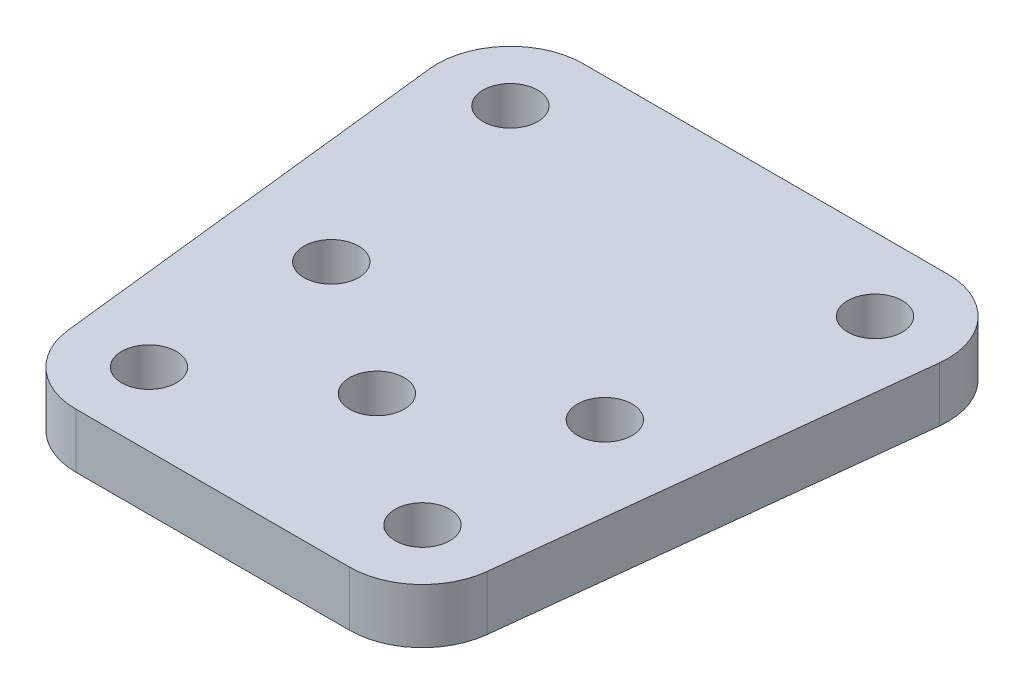
ISO-10303-21;
HEADER;
FILE_DESCRIPTION(('STEP AP214'),'2;1');
FILE_NAME('part.step','',(''),(''),'','','');
FILE_SCHEMA(('AUTOMOTIVE_DESIGN { 1 0 10303 214 1 1 1 1 }'));
ENDSEC;
DATA;
#1=APPLICATION_CONTEXT('core data for automotive mechanical design processes');
#2=APPLICATION_PROTOCOL_DEFINITION('international standard','automotive_design',2000,#1);
#3=PRODUCT_CONTEXT('',#1,'mechanical');
#4=PRODUCT('Part','Part','',(#3));
#5=PRODUCT_RELATED_PRODUCT_CATEGORY('part','',(#4));
#6=PRODUCT_DEFINITION_FORMATION('','',#4);
#7=PRODUCT_DEFINITION_CONTEXT('part definition',#1,'design');
#8=PRODUCT_DEFINITION('design','',#6,#7);
#9=PRODUCT_DEFINITION_SHAPE('','',#8);
#10=(LENGTH_UNIT() NAMED_UNIT(*) SI_UNIT(.MILLI.,.METRE.));
#11=(NAMED_UNIT(*) PLANE_ANGLE_UNIT() SI_UNIT($,.RADIAN.));
#12=(NAMED_UNIT(*) SI_UNIT($,.STERADIAN.) SOLID_ANGLE_UNIT());
#13=UNCERTAINTY_MEASURE_WITH_UNIT(LENGTH_MEASURE(1.E-05),#10,'distance_accuracy_value','');
#14=(GEOMETRIC_REPRESENTATION_CONTEXT(3) GLOBAL_UNCERTAINTY_ASSIGNED_CONTEXT((#13)) GLOBAL_UNIT_ASSIGNED_CONTEXT((#10,
#11,#12)) REPRESENTATION_CONTEXT('',''));
#15=CARTESIAN_POINT('',(0.,0.,0.));
#16=DIRECTION('',(0.,0.,1.));
#17=DIRECTION('',(1.,0.,0.));
#18=AXIS2_PLACEMENT_3D('',#15,#16,#17);
#19=CARTESIAN_POINT('',(-6.48360028265578,3.,-9.78305461340109));
#20=DIRECTION('',(0.,1.,0.));
#21=DIRECTION('',(0.,0.,1.));
#22=AXIS2_PLACEMENT_3D('',#19,#20,#21);
#23=PLANE('',#22);
#24=CARTESIAN_POINT('',(13.5163997173442,3.,-9.78305461340117));
#25=DIRECTION('',(0.,1.,0.));
#26=DIRECTION('',(0.,0.,1.));
#27=AXIS2_PLACEMENT_3D('',#24,#25,#26);
#28=CIRCLE('',#27,1.49999999999999);
#29=CARTESIAN_POINT('',(13.5163997173442,3.,-8.28305461340118));
#30=VERTEX_POINT('',#29);
#31=EDGE_CURVE('E251',#30,#30,#28,.T.);
#32=ORIENTED_EDGE('',*,*,#31,.F.);
#33=EDGE_LOOP('',(#32));
#34=FACE_BOUND('',#33,.T.);
#35=CARTESIAN_POINT('',(11.0163997173443,3.,2.53745346228764));
#36=DIRECTION('',(0.,1.,0.));
#37=DIRECTION('',(0.,0.,1.));
#38=AXIS2_PLACEMENT_3D('',#35,#36,#37);
#39=CIRCLE('',#38,1.49999999999999);
#40=CARTESIAN_POINT('',(11.0163997173443,3.,4.03745346228764));
#41=VERTEX_POINT('',#40);
#42=EDGE_CURVE('E235',#41,#41,#39,.T.);
#43=ORIENTED_EDGE('',*,*,#42,.F.);
#44=EDGE_LOOP('',(#43));
#45=FACE_BOUND('',#44,.T.);
#46=CARTESIAN_POINT('',(11.0163997173443,3.,12.5374534622876));
#47=DIRECTION('',(0.,1.,0.));
#48=DIRECTION('',(0.,0.,1.));
#49=AXIS2_PLACEMENT_3D('',#46,#47,#48);
#50=CIRCLE('',#49,1.5);
#51=CARTESIAN_POINT('',(11.0163997173443,3.,14.0374534622876));
#52=VERTEX_POINT('',#51);
#53=EDGE_CURVE('E219',#52,#52,#50,.T.);
#54=ORIENTED_EDGE('',*,*,#53,.F.);
#55=EDGE_LOOP('',(#54));
#56=FACE_BOUND('',#55,.T.);
#57=CARTESIAN_POINT('',(-6.48360028265578,3.,-9.78305461340109));
#58=DIRECTION('',(0.,1.,0.));
#59=DIRECTION('',(0.,0.,1.));
#60=AXIS2_PLACEMENT_3D('',#57,#58,#59);
#61=CIRCLE('',#60,4.00000000000001);
#62=CARTESIAN_POINT('',(-6.4836002826558,3.,-13.7830546134011));
#63=VERTEX_POINT('',#62);
#64=CARTESIAN_POINT('',(-10.4587438390994,3.,-9.33782017440847));
#65=VERTEX_POINT('',#64);
#66=EDGE_CURVE('E170',#63,#65,#61,.T.);
#67=ORIENTED_EDGE('',*,*,#66,.T.);
#68=DIRECTION('',(0.111308609748152,0.,0.993785889110896));
#69=VECTOR('',#68,1.);
#70=CARTESIAN_POINT('',(-10.4587438390994,3.,-9.33782017440847));
#71=LINE('',#70,#69);
#72=CARTESIAN_POINT('',(-7.95874383909929,3.,12.9826879012803));
#73=VERTEX_POINT('',#72);
#74=EDGE_CURVE('E106',#65,#73,#71,.T.);
#75=ORIENTED_EDGE('',*,*,#74,.T.);
#76=CARTESIAN_POINT('',(-3.98360028265569,3.,12.5374534622877));
#77=DIRECTION('',(0.,1.,0.));
#78=DIRECTION('',(0.,0.,1.));
#79=AXIS2_PLACEMENT_3D('',#76,#77,#78);
#80=CIRCLE('',#79,4.00000000000001);
#81=CARTESIAN_POINT('',(-3.98360028265569,3.,16.5374534622877));
#82=VERTEX_POINT('',#81);
#83=EDGE_CURVE('E191',#73,#82,#80,.T.);
#84=ORIENTED_EDGE('',*,*,#83,.T.);
#85=DIRECTION('',(1.,0.,0.));
#86=VECTOR('',#85,1.);
#87=CARTESIAN_POINT('',(-3.98360028265568,3.,16.5374534622877));
#88=LINE('',#87,#86);
#89=CARTESIAN_POINT('',(11.0163997173443,3.,16.5374534622876));
#90=VERTEX_POINT('',#89);
#91=EDGE_CURVE('E205',#82,#90,#88,.T.);
#92=ORIENTED_EDGE('',*,*,#91,.T.);
#93=CARTESIAN_POINT('',(11.0163997173443,3.,12.5374534622876));
#94=DIRECTION('',(0.,1.,0.));
#95=DIRECTION('',(0.,0.,1.));
#96=AXIS2_PLACEMENT_3D('',#93,#94,#95);
#97=CIRCLE('',#96,4.00000000000001);
#98=CARTESIAN_POINT('',(14.9915432737879,3.,12.9826879012802));
#99=VERTEX_POINT('',#98);
#100=EDGE_CURVE('E125',#90,#99,#97,.T.);
#101=ORIENTED_EDGE('',*,*,#100,.T.);
#102=DIRECTION('',(0.111308609748144,0.,-0.993785889110897));
#103=VECTOR('',#102,1.);
#104=CARTESIAN_POINT('',(14.9915432737879,3.,12.9826879012802));
#105=LINE('',#104,#103);
#106=CARTESIAN_POINT('',(17.4915432737878,3.,-9.33782017440858));
#107=VERTEX_POINT('',#106);
#108=EDGE_CURVE('E119',#99,#107,#105,.T.);
#109=ORIENTED_EDGE('',*,*,#108,.T.);
#110=CARTESIAN_POINT('',(13.5163997173442,3.,-9.78305461340117));
#111=DIRECTION('',(0.,1.,0.));
#112=DIRECTION('',(0.,0.,1.));
#113=AXIS2_PLACEMENT_3D('',#110,#111,#112);
#114=CIRCLE('',#113,4.00000000000001);
#115=CARTESIAN_POINT('',(13.5163997173442,3.,-13.7830546134012));
#116=VERTEX_POINT('',#115);
#117=EDGE_CURVE('E123',#107,#116,#114,.T.);
#118=ORIENTED_EDGE('',*,*,#117,.T.);
#119=DIRECTION('',(-1.,0.,0.));
#120=VECTOR('',#119,1.);
#121=CARTESIAN_POINT('',(13.5163997173442,3.,-13.7830546134012));
#122=LINE('',#121,#120);
#123=EDGE_CURVE('E63',#116,#63,#122,.T.);
#124=ORIENTED_EDGE('',*,*,#123,.T.);
#125=EDGE_LOOP('',(#67,#75,#84,#92,#101,#109,#118,#124));
#126=FACE_BOUND('',#125,.T.);
#127=CARTESIAN_POINT('',(-3.98360028265569,3.,12.5374534622877));
#128=DIRECTION('',(0.,1.,0.));
#129=DIRECTION('',(0.,0.,1.));
#130=AXIS2_PLACEMENT_3D('',#127,#128,#129);
#131=CIRCLE('',#130,1.5);
#132=CARTESIAN_POINT('',(-3.98360028265569,3.,14.0374534622877));
#133=VERTEX_POINT('',#132);
#134=EDGE_CURVE('E152',#133,#133,#131,.T.);
#135=ORIENTED_EDGE('',*,*,#134,.F.);
#136=EDGE_LOOP('',(#135));
#137=FACE_BOUND('',#136,.T.);
#138=CARTESIAN_POINT('',(3.51639971734429,3.,7.53745346228767));
#139=DIRECTION('',(0.,1.,0.));
#140=DIRECTION('',(0.,0.,1.));
#141=AXIS2_PLACEMENT_3D('',#138,#139,#140);
#142=CIRCLE('',#141,1.5);
#143=CARTESIAN_POINT('',(3.51639971734429,3.,9.03745346228767));
#144=VERTEX_POINT('',#143);
#145=EDGE_CURVE('E227',#144,#144,#142,.T.);
#146=ORIENTED_EDGE('',*,*,#145,.F.);
#147=EDGE_LOOP('',(#146));
#148=FACE_BOUND('',#147,.T.);
#149=CARTESIAN_POINT('',(-3.98360028265573,3.,2.5374534622877));
#150=DIRECTION('',(0.,1.,0.));
#151=DIRECTION('',(0.,0.,1.));
#152=AXIS2_PLACEMENT_3D('',#149,#150,#151);
#153=CIRCLE('',#152,1.5);
#154=CARTESIAN_POINT('',(-3.98360028265573,3.,4.0374534622877));
#155=VERTEX_POINT('',#154);
#156=EDGE_CURVE('E243',#155,#155,#153,.T.);
#157=ORIENTED_EDGE('',*,*,#156,.F.);
#158=EDGE_LOOP('',(#157));
#159=FACE_BOUND('',#158,.T.);
#160=CARTESIAN_POINT('',(-6.48360028265578,3.,-9.78305461340109));
#161=DIRECTION('',(0.,1.,0.));
#162=DIRECTION('',(0.,0.,1.));
#163=AXIS2_PLACEMENT_3D('',#160,#161,#162);
#164=CIRCLE('',#163,1.5);
#165=CARTESIAN_POINT('',(-6.48360028265578,3.,-8.28305461340109));
#166=VERTEX_POINT('',#165);
#167=EDGE_CURVE('E259',#166,#166,#164,.T.);
#168=ORIENTED_EDGE('',*,*,#167,.F.);
#169=EDGE_LOOP('',(#168));
#170=FACE_BOUND('',#169,.T.);
#171=ADVANCED_FACE('F45',(#34,#45,#56,#126,#137,#148,#159,#170),#23,.T.);
#172=CARTESIAN_POINT('',(-6.48360028265578,0.,-9.78305461340109));
#173=DIRECTION('',(0.,1.,0.));
#174=DIRECTION('',(0.,0.,1.));
#175=AXIS2_PLACEMENT_3D('',#172,#173,#174);
#176=PLANE('',#175);
#177=CARTESIAN_POINT('',(-6.48360028265578,0.,-9.78305461340109));
#178=DIRECTION('',(0.,1.,0.));
#179=DIRECTION('',(0.,0.,1.));
#180=AXIS2_PLACEMENT_3D('',#177,#178,#179);
#181=CIRCLE('',#180,4.00000000000001);
#182=CARTESIAN_POINT('',(-6.4836002826558,0.,-13.7830546134011));
#183=VERTEX_POINT('',#182);
#184=CARTESIAN_POINT('',(-10.4587438390994,0.,-9.33782017440847));
#185=VERTEX_POINT('',#184);
#186=EDGE_CURVE('E147',#183,#185,#181,.T.);
#187=ORIENTED_EDGE('',*,*,#186,.F.);
#188=DIRECTION('',(-1.,0.,0.));
#189=VECTOR('',#188,1.);
#190=CARTESIAN_POINT('',(13.5163997173442,0.,-13.7830546134012));
#191=LINE('',#190,#189);
#192=CARTESIAN_POINT('',(13.5163997173442,0.,-13.7830546134012));
#193=VERTEX_POINT('',#192);
#194=EDGE_CURVE('E98',#193,#183,#191,.T.);
#195=ORIENTED_EDGE('',*,*,#194,.F.);
#196=CARTESIAN_POINT('',(13.5163997173442,0.,-9.78305461340117));
#197=DIRECTION('',(0.,1.,0.));
#198=DIRECTION('',(0.,0.,1.));
#199=AXIS2_PLACEMENT_3D('',#196,#197,#198);
#200=CIRCLE('',#199,4.00000000000001);
#201=CARTESIAN_POINT('',(17.4915432737878,0.,-9.33782017440858));
#202=VERTEX_POINT('',#201);
#203=EDGE_CURVE('E92',#202,#193,#200,.T.);
#204=ORIENTED_EDGE('',*,*,#203,.F.);
#205=DIRECTION('',(0.111308609748144,0.,-0.993785889110897));
#206=VECTOR('',#205,1.);
#207=CARTESIAN_POINT('',(14.9915432737879,0.,12.9826879012802));
#208=LINE('',#207,#206);
#209=CARTESIAN_POINT('',(14.9915432737879,0.,12.9826879012802));
#210=VERTEX_POINT('',#209);
#211=EDGE_CURVE('E134',#210,#202,#208,.T.);
#212=ORIENTED_EDGE('',*,*,#211,.F.);
#213=CARTESIAN_POINT('',(11.0163997173443,0.,12.5374534622876));
#214=DIRECTION('',(0.,1.,0.));
#215=DIRECTION('',(0.,0.,1.));
#216=AXIS2_PLACEMENT_3D('',#213,#214,#215);
#217=CIRCLE('',#216,4.00000000000001);
#218=CARTESIAN_POINT('',(11.0163997173443,0.,16.5374534622876));
#219=VERTEX_POINT('',#218);
#220=EDGE_CURVE('E161',#219,#210,#217,.T.);
#221=ORIENTED_EDGE('',*,*,#220,.F.);
#222=DIRECTION('',(1.,0.,0.));
#223=VECTOR('',#222,1.);
#224=CARTESIAN_POINT('',(-3.98360028265568,0.,16.5374534622877));
#225=LINE('',#224,#223);
#226=CARTESIAN_POINT('',(-3.98360028265569,0.,16.5374534622877));
#227=VERTEX_POINT('',#226);
#228=EDGE_CURVE('E158',#227,#219,#225,.T.);
#229=ORIENTED_EDGE('',*,*,#228,.F.);
#230=CARTESIAN_POINT('',(-3.98360028265569,0.,12.5374534622877));
#231=DIRECTION('',(0.,1.,0.));
#232=DIRECTION('',(0.,0.,1.));
#233=AXIS2_PLACEMENT_3D('',#230,#231,#232);
#234=CIRCLE('',#233,4.00000000000001);
#235=CARTESIAN_POINT('',(-7.95874383909929,0.,12.9826879012803));
#236=VERTEX_POINT('',#235);
#237=EDGE_CURVE('E155',#236,#227,#234,.T.);
#238=ORIENTED_EDGE('',*,*,#237,.F.);
#239=DIRECTION('',(0.111308609748152,0.,0.993785889110896));
#240=VECTOR('',#239,1.);
#241=CARTESIAN_POINT('',(-10.4587438390994,0.,-9.33782017440847));
#242=LINE('',#241,#240);
#243=EDGE_CURVE('E151',#185,#236,#242,.T.);
#244=ORIENTED_EDGE('',*,*,#243,.F.);
#245=EDGE_LOOP('',(#187,#195,#204,#212,#221,#229,#238,#244));
#246=FACE_BOUND('',#245,.T.);
#247=CARTESIAN_POINT('',(-3.98360028265569,0.,12.5374534622877));
#248=DIRECTION('',(0.,1.,0.));
#249=DIRECTION('',(0.,0.,1.));
#250=AXIS2_PLACEMENT_3D('',#247,#248,#249);
#251=CIRCLE('',#250,1.5);
#252=CARTESIAN_POINT('',(-3.98360028265569,0.,14.0374534622877));
#253=VERTEX_POINT('',#252);
#254=EDGE_CURVE('E215',#253,#253,#251,.T.);
#255=ORIENTED_EDGE('',*,*,#254,.T.);
#256=EDGE_LOOP('',(#255));
#257=FACE_BOUND('',#256,.T.);
#258=CARTESIAN_POINT('',(11.0163997173443,0.,12.5374534622876));
#259=DIRECTION('',(0.,1.,0.));
#260=DIRECTION('',(0.,0.,1.));
#261=AXIS2_PLACEMENT_3D('',#258,#259,#260);
#262=CIRCLE('',#261,1.5);
#263=CARTESIAN_POINT('',(11.0163997173443,0.,14.0374534622876));
#264=VERTEX_POINT('',#263);
#265=EDGE_CURVE('E223',#264,#264,#262,.T.);
#266=ORIENTED_EDGE('',*,*,#265,.T.);
#267=EDGE_LOOP('',(#266));
#268=FACE_BOUND('',#267,.T.);
#269=CARTESIAN_POINT('',(3.51639971734429,0.,7.53745346228767));
#270=DIRECTION('',(0.,1.,0.));
#271=DIRECTION('',(0.,0.,1.));
#272=AXIS2_PLACEMENT_3D('',#269,#270,#271);
#273=CIRCLE('',#272,1.5);
#274=CARTESIAN_POINT('',(3.51639971734429,0.,9.03745346228767));
#275=VERTEX_POINT('',#274);
#276=EDGE_CURVE('E231',#275,#275,#273,.T.);
#277=ORIENTED_EDGE('',*,*,#276,.T.);
#278=EDGE_LOOP('',(#277));
#279=FACE_BOUND('',#278,.T.);
#280=CARTESIAN_POINT('',(11.0163997173443,0.,2.53745346228764));
#281=DIRECTION('',(0.,1.,0.));
#282=DIRECTION('',(0.,0.,1.));
#283=AXIS2_PLACEMENT_3D('',#280,#281,#282);
#284=CIRCLE('',#283,1.49999999999999);
#285=CARTESIAN_POINT('',(11.0163997173443,0.,4.03745346228764));
#286=VERTEX_POINT('',#285);
#287=EDGE_CURVE('E239',#286,#286,#284,.T.);
#288=ORIENTED_EDGE('',*,*,#287,.T.);
#289=EDGE_LOOP('',(#288));
#290=FACE_BOUND('',#289,.T.);
#291=CARTESIAN_POINT('',(-3.98360028265573,0.,2.5374534622877));
#292=DIRECTION('',(0.,1.,0.));
#293=DIRECTION('',(0.,0.,1.));
#294=AXIS2_PLACEMENT_3D('',#291,#292,#293);
#295=CIRCLE('',#294,1.5);
#296=CARTESIAN_POINT('',(-3.98360028265573,0.,4.0374534622877));
#297=VERTEX_POINT('',#296);
#298=EDGE_CURVE('E247',#297,#297,#295,.T.);
#299=ORIENTED_EDGE('',*,*,#298,.T.);
#300=EDGE_LOOP('',(#299));
#301=FACE_BOUND('',#300,.T.);
#302=CARTESIAN_POINT('',(13.5163997173442,0.,-9.78305461340117));
#303=DIRECTION('',(0.,1.,0.));
#304=DIRECTION('',(0.,0.,1.));
#305=AXIS2_PLACEMENT_3D('',#302,#303,#304);
#306=CIRCLE('',#305,1.49999999999999);
#307=CARTESIAN_POINT('',(13.5163997173442,0.,-8.28305461340118));
#308=VERTEX_POINT('',#307);
#309=EDGE_CURVE('E255',#308,#308,#306,.T.);
#310=ORIENTED_EDGE('',*,*,#309,.T.);
#311=EDGE_LOOP('',(#310));
#312=FACE_BOUND('',#311,.T.);
#313=CARTESIAN_POINT('',(-6.48360028265578,0.,-9.78305461340109));
#314=DIRECTION('',(0.,1.,0.));
#315=DIRECTION('',(0.,0.,1.));
#316=AXIS2_PLACEMENT_3D('',#313,#314,#315);
#317=CIRCLE('',#316,1.5);
#318=CARTESIAN_POINT('',(-6.48360028265578,0.,-8.28305461340109));
#319=VERTEX_POINT('',#318);
#320=EDGE_CURVE('E263',#319,#319,#317,.T.);
#321=ORIENTED_EDGE('',*,*,#320,.T.);
#322=EDGE_LOOP('',(#321));
#323=FACE_BOUND('',#322,.T.);
#324=ADVANCED_FACE('F195',(#246,#257,#268,#279,#290,#301,#312,#323),#176,.F.);
#325=CARTESIAN_POINT('',(-6.48360028265578,3.,-9.78305461340109));
#326=DIRECTION('',(0.,-1.,0.));
#327=DIRECTION('',(0.,0.,-1.));
#328=AXIS2_PLACEMENT_3D('',#325,#326,#327);
#329=CYLINDRICAL_SURFACE('',#328,4.00000000000001);
#330=ORIENTED_EDGE('',*,*,#186,.T.);
#331=DIRECTION('',(0.,-1.,0.));
#332=VECTOR('',#331,1.);
#333=CARTESIAN_POINT('',(-10.4587438390994,3.,-9.33782017440847));
#334=LINE('',#333,#332);
#335=EDGE_CURVE('E11',#65,#185,#334,.T.);
#336=ORIENTED_EDGE('',*,*,#335,.F.);
#337=ORIENTED_EDGE('',*,*,#66,.F.);
#338=DIRECTION('',(0.,-1.,0.));
#339=VECTOR('',#338,1.);
#340=CARTESIAN_POINT('',(-6.4836002826558,3.,-13.7830546134011));
#341=LINE('',#340,#339);
#342=EDGE_CURVE('E143',#63,#183,#341,.T.);
#343=ORIENTED_EDGE('',*,*,#342,.T.);
#344=EDGE_LOOP('',(#330,#336,#337,#343));
#345=FACE_BOUND('',#344,.T.);
#346=ADVANCED_FACE('F47',(#345),#329,.T.);
#347=CARTESIAN_POINT('',(-10.4587438390994,3.,-9.33782017440847));
#348=DIRECTION('',(0.993785889110896,0.,-0.111308609748152));
#349=DIRECTION('',(-0.111308609748152,0.,-0.993785889110896));
#350=AXIS2_PLACEMENT_3D('',#347,#348,#349);
#351=PLANE('',#350);
#352=ORIENTED_EDGE('',*,*,#243,.T.);
#353=DIRECTION('',(0.,-1.,0.));
#354=VECTOR('',#353,1.);
#355=CARTESIAN_POINT('',(-7.95874383909929,3.,12.9826879012803));
#356=LINE('',#355,#354);
#357=EDGE_CURVE('E55',#73,#236,#356,.T.);
#358=ORIENTED_EDGE('',*,*,#357,.F.);
#359=ORIENTED_EDGE('',*,*,#74,.F.);
#360=ORIENTED_EDGE('',*,*,#335,.T.);
#361=EDGE_LOOP('',(#352,#358,#359,#360));
#362=FACE_BOUND('',#361,.T.);
#363=ADVANCED_FACE('F299',(#362),#351,.F.);
#364=CARTESIAN_POINT('',(-3.98360028265569,3.,12.5374534622877));
#365=DIRECTION('',(0.,-1.,0.));
#366=DIRECTION('',(0.,0.,-1.));
#367=AXIS2_PLACEMENT_3D('',#364,#365,#366);
#368=CYLINDRICAL_SURFACE('',#367,4.00000000000001);
#369=ORIENTED_EDGE('',*,*,#237,.T.);
#370=DIRECTION('',(0.,-1.,0.));
#371=VECTOR('',#370,1.);
#372=CARTESIAN_POINT('',(-3.98360028265569,3.,16.5374534622877));
#373=LINE('',#372,#371);
#374=EDGE_CURVE('E181',#82,#227,#373,.T.);
#375=ORIENTED_EDGE('',*,*,#374,.F.);
#376=ORIENTED_EDGE('',*,*,#83,.F.);
#377=ORIENTED_EDGE('',*,*,#357,.T.);
#378=EDGE_LOOP('',(#369,#375,#376,#377));
#379=FACE_BOUND('',#378,.T.);
#380=ADVANCED_FACE('F189',(#379),#368,.T.);
#381=CARTESIAN_POINT('',(-3.98360028265568,3.,16.5374534622877));
#382=DIRECTION('',(0.,0.,-1.));
#383=DIRECTION('',(-1.,0.,0.));
#384=AXIS2_PLACEMENT_3D('',#381,#382,#383);
#385=PLANE('',#384);
#386=ORIENTED_EDGE('',*,*,#228,.T.);
#387=DIRECTION('',(0.,-1.,0.));
#388=VECTOR('',#387,1.);
#389=CARTESIAN_POINT('',(11.0163997173443,3.,16.5374534622876));
#390=LINE('',#389,#388);
#391=EDGE_CURVE('E177',#90,#219,#390,.T.);
#392=ORIENTED_EDGE('',*,*,#391,.F.);
#393=ORIENTED_EDGE('',*,*,#91,.F.);
#394=ORIENTED_EDGE('',*,*,#374,.T.);
#395=EDGE_LOOP('',(#386,#392,#393,#394));
#396=FACE_BOUND('',#395,.T.);
#397=ADVANCED_FACE('F200',(#396),#385,.F.);
#398=CARTESIAN_POINT('',(11.0163997173443,3.,12.5374534622876));
#399=DIRECTION('',(0.,-1.,0.));
#400=DIRECTION('',(0.,0.,-1.));
#401=AXIS2_PLACEMENT_3D('',#398,#399,#400);
#402=CYLINDRICAL_SURFACE('',#401,4.00000000000001);
#403=ORIENTED_EDGE('',*,*,#220,.T.);
#404=DIRECTION('',(0.,-1.,0.));
#405=VECTOR('',#404,1.);
#406=CARTESIAN_POINT('',(14.9915432737879,3.,12.9826879012802));
#407=LINE('',#406,#405);
#408=EDGE_CURVE('E136',#99,#210,#407,.T.);
#409=ORIENTED_EDGE('',*,*,#408,.F.);
#410=ORIENTED_EDGE('',*,*,#100,.F.);
#411=ORIENTED_EDGE('',*,*,#391,.T.);
#412=EDGE_LOOP('',(#403,#409,#410,#411));
#413=FACE_BOUND('',#412,.T.);
#414=ADVANCED_FACE('F203',(#413),#402,.T.);
#415=CARTESIAN_POINT('',(14.9915432737879,3.,12.9826879012802));
#416=DIRECTION('',(-0.993785889110896,0.,-0.111308609748144));
#417=DIRECTION('',(-0.111308609748144,0.,0.993785889110897));
#418=AXIS2_PLACEMENT_3D('',#415,#416,#417);
#419=PLANE('',#418);
#420=ORIENTED_EDGE('',*,*,#211,.T.);
#421=DIRECTION('',(0.,-1.,0.));
#422=VECTOR('',#421,1.);
#423=CARTESIAN_POINT('',(17.4915432737878,3.,-9.33782017440858));
#424=LINE('',#423,#422);
#425=EDGE_CURVE('E131',#107,#202,#424,.T.);
#426=ORIENTED_EDGE('',*,*,#425,.F.);
#427=ORIENTED_EDGE('',*,*,#108,.F.);
#428=ORIENTED_EDGE('',*,*,#408,.T.);
#429=EDGE_LOOP('',(#420,#426,#427,#428));
#430=FACE_BOUND('',#429,.T.);
#431=ADVANCED_FACE('F132',(#430),#419,.F.);
#432=CARTESIAN_POINT('',(13.5163997173442,3.,-9.78305461340117));
#433=DIRECTION('',(0.,-1.,0.));
#434=DIRECTION('',(0.,0.,-1.));
#435=AXIS2_PLACEMENT_3D('',#432,#433,#434);
#436=CYLINDRICAL_SURFACE('',#435,4.00000000000001);
#437=ORIENTED_EDGE('',*,*,#203,.T.);
#438=DIRECTION('',(0.,-1.,0.));
#439=VECTOR('',#438,1.);
#440=CARTESIAN_POINT('',(13.5163997173442,3.,-13.7830546134012));
#441=LINE('',#440,#439);
#442=EDGE_CURVE('E137',#116,#193,#441,.T.);
#443=ORIENTED_EDGE('',*,*,#442,.F.);
#444=ORIENTED_EDGE('',*,*,#117,.F.);
#445=ORIENTED_EDGE('',*,*,#425,.T.);
#446=EDGE_LOOP('',(#437,#443,#444,#445));
#447=FACE_BOUND('',#446,.T.);
#448=ADVANCED_FACE('F139',(#447),#436,.T.);
#449=CARTESIAN_POINT('',(13.5163997173442,3.,-13.7830546134012));
#450=DIRECTION('',(0.,0.,1.));
#451=DIRECTION('',(1.,0.,0.));
#452=AXIS2_PLACEMENT_3D('',#449,#450,#451);
#453=PLANE('',#452);
#454=ORIENTED_EDGE('',*,*,#194,.T.);
#455=ORIENTED_EDGE('',*,*,#342,.F.);
#456=ORIENTED_EDGE('',*,*,#123,.F.);
#457=ORIENTED_EDGE('',*,*,#442,.T.);
#458=EDGE_LOOP('',(#454,#455,#456,#457));
#459=FACE_BOUND('',#458,.T.);
#460=ADVANCED_FACE('F287',(#459),#453,.F.);
#461=CARTESIAN_POINT('',(-3.98360028265569,3.,12.5374534622877));
#462=DIRECTION('',(0.,-1.,0.));
#463=DIRECTION('',(0.,0.,-1.));
#464=AXIS2_PLACEMENT_3D('',#461,#462,#463);
#465=CYLINDRICAL_SURFACE('',#464,1.5);
#466=ORIENTED_EDGE('',*,*,#134,.T.);
#467=EDGE_LOOP('',(#466));
#468=FACE_BOUND('',#467,.T.);
#469=ORIENTED_EDGE('',*,*,#254,.F.);
#470=EDGE_LOOP('',(#469));
#471=FACE_BOUND('',#470,.T.);
#472=ADVANCED_FACE('F284',(#468,#471),#465,.F.);
#473=CARTESIAN_POINT('',(11.0163997173443,3.,12.5374534622876));
#474=DIRECTION('',(0.,-1.,0.));
#475=DIRECTION('',(0.,0.,-1.));
#476=AXIS2_PLACEMENT_3D('',#473,#474,#475);
#477=CYLINDRICAL_SURFACE('',#476,1.5);
#478=ORIENTED_EDGE('',*,*,#53,.T.);
#479=EDGE_LOOP('',(#478));
#480=FACE_BOUND('',#479,.T.);
#481=ORIENTED_EDGE('',*,*,#265,.F.);
#482=EDGE_LOOP('',(#481));
#483=FACE_BOUND('',#482,.T.);
#484=ADVANCED_FACE('F362',(#480,#483),#477,.F.);
#485=CARTESIAN_POINT('',(3.51639971734429,3.,7.53745346228767));
#486=DIRECTION('',(0.,-1.,0.));
#487=DIRECTION('',(0.,0.,-1.));
#488=AXIS2_PLACEMENT_3D('',#485,#486,#487);
#489=CYLINDRICAL_SURFACE('',#488,1.5);
#490=ORIENTED_EDGE('',*,*,#145,.T.);
#491=EDGE_LOOP('',(#490));
#492=FACE_BOUND('',#491,.T.);
#493=ORIENTED_EDGE('',*,*,#276,.F.);
#494=EDGE_LOOP('',(#493));
#495=FACE_BOUND('',#494,.T.);
#496=ADVANCED_FACE('F370',(#492,#495),#489,.F.);
#497=CARTESIAN_POINT('',(11.0163997173443,3.,2.53745346228764));
#498=DIRECTION('',(0.,-1.,0.));
#499=DIRECTION('',(0.,0.,-1.));
#500=AXIS2_PLACEMENT_3D('',#497,#498,#499);
#501=CYLINDRICAL_SURFACE('',#500,1.49999999999999);
#502=ORIENTED_EDGE('',*,*,#42,.T.);
#503=EDGE_LOOP('',(#502));
#504=FACE_BOUND('',#503,.T.);
#505=ORIENTED_EDGE('',*,*,#287,.F.);
#506=EDGE_LOOP('',(#505));
#507=FACE_BOUND('',#506,.T.);
#508=ADVANCED_FACE('F378',(#504,#507),#501,.F.);
#509=CARTESIAN_POINT('',(-3.98360028265573,3.,2.5374534622877));
#510=DIRECTION('',(0.,-1.,0.));
#511=DIRECTION('',(0.,0.,-1.));
#512=AXIS2_PLACEMENT_3D('',#509,#510,#511);
#513=CYLINDRICAL_SURFACE('',#512,1.5);
#514=ORIENTED_EDGE('',*,*,#156,.T.);
#515=EDGE_LOOP('',(#514));
#516=FACE_BOUND('',#515,.T.);
#517=ORIENTED_EDGE('',*,*,#298,.F.);
#518=EDGE_LOOP('',(#517));
#519=FACE_BOUND('',#518,.T.);
#520=ADVANCED_FACE('F387',(#516,#519),#513,.F.);
#521=CARTESIAN_POINT('',(13.5163997173442,3.,-9.78305461340117));
#522=DIRECTION('',(0.,-1.,0.));
#523=DIRECTION('',(0.,0.,-1.));
#524=AXIS2_PLACEMENT_3D('',#521,#522,#523);
#525=CYLINDRICAL_SURFACE('',#524,1.49999999999999);
#526=ORIENTED_EDGE('',*,*,#31,.T.);
#527=EDGE_LOOP('',(#526));
#528=FACE_BOUND('',#527,.T.);
#529=ORIENTED_EDGE('',*,*,#309,.F.);
#530=EDGE_LOOP('',(#529));
#531=FACE_BOUND('',#530,.T.);
#532=ADVANCED_FACE('F396',(#528,#531),#525,.F.);
#533=CARTESIAN_POINT('',(-6.48360028265578,3.,-9.78305461340109));
#534=DIRECTION('',(0.,-1.,0.));
#535=DIRECTION('',(0.,0.,-1.));
#536=AXIS2_PLACEMENT_3D('',#533,#534,#535);
#537=CYLINDRICAL_SURFACE('',#536,1.5);
#538=ORIENTED_EDGE('',*,*,#167,.T.);
#539=EDGE_LOOP('',(#538));
#540=FACE_BOUND('',#539,.T.);
#541=ORIENTED_EDGE('',*,*,#320,.F.);
#542=EDGE_LOOP('',(#541));
#543=FACE_BOUND('',#542,.T.);
#544=ADVANCED_FACE('F271',(#540,#543),#537,.F.);
#545=CLOSED_SHELL('',(#171,#324,#346,#363,#380,#397,#414,#431,#448,#460,#472,#484,#496,#508,
#520,#532,#544));
#546=MANIFOLD_SOLID_BREP('B2',#545);
#547=ADVANCED_BREP_SHAPE_REPRESENTATION('',(#18,#546),#14);
#548=SHAPE_DEFINITION_REPRESENTATION(#9,#547);
ENDSEC;
END-ISO-10303-21;
